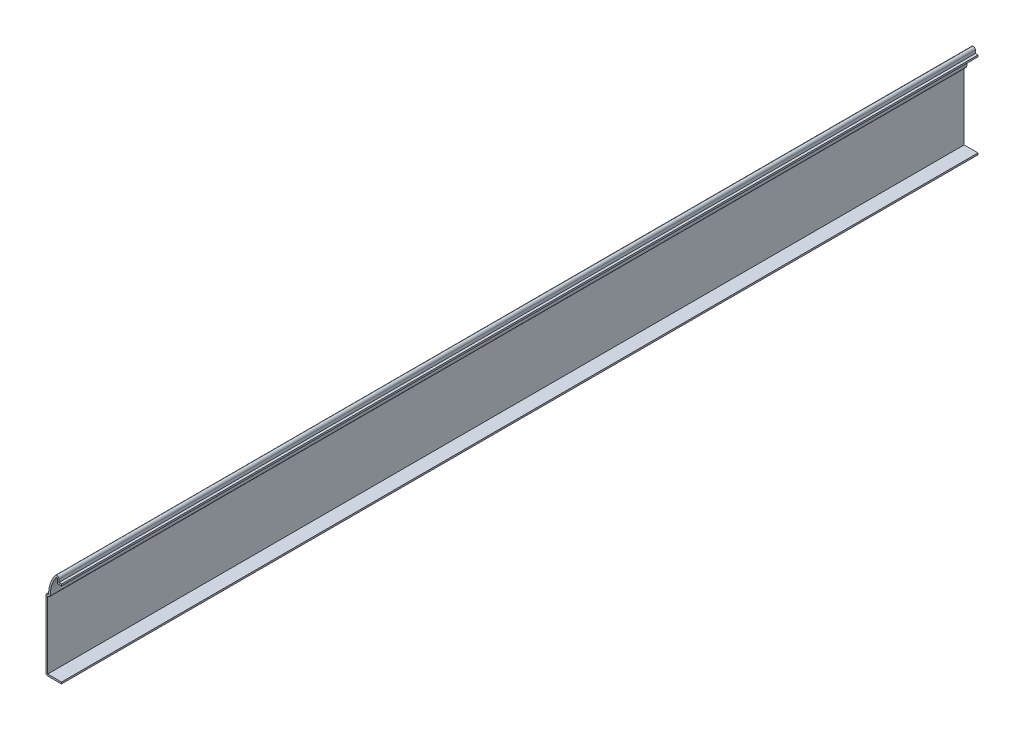
ISO-10303-21;
HEADER;
FILE_DESCRIPTION(('STEP AP214'),'2;1');
FILE_NAME('part.step','',(''),(''),'','','');
FILE_SCHEMA(('AUTOMOTIVE_DESIGN { 1 0 10303 214 1 1 1 1 }'));
ENDSEC;
DATA;
#1=APPLICATION_CONTEXT('core data for automotive mechanical design processes');
#2=APPLICATION_PROTOCOL_DEFINITION('international standard','automotive_design',2000,#1);
#3=PRODUCT_CONTEXT('',#1,'mechanical');
#4=PRODUCT('Part','Part','',(#3));
#5=PRODUCT_RELATED_PRODUCT_CATEGORY('part','',(#4));
#6=PRODUCT_DEFINITION_FORMATION('','',#4);
#7=PRODUCT_DEFINITION_CONTEXT('part definition',#1,'design');
#8=PRODUCT_DEFINITION('design','',#6,#7);
#9=PRODUCT_DEFINITION_SHAPE('','',#8);
#10=(LENGTH_UNIT() NAMED_UNIT(*) SI_UNIT(.MILLI.,.METRE.));
#11=(NAMED_UNIT(*) PLANE_ANGLE_UNIT() SI_UNIT($,.RADIAN.));
#12=(NAMED_UNIT(*) SI_UNIT($,.STERADIAN.) SOLID_ANGLE_UNIT());
#13=UNCERTAINTY_MEASURE_WITH_UNIT(LENGTH_MEASURE(1.E-05),#10,'distance_accuracy_value','');
#14=(GEOMETRIC_REPRESENTATION_CONTEXT(3) GLOBAL_UNCERTAINTY_ASSIGNED_CONTEXT((#13)) GLOBAL_UNIT_ASSIGNED_CONTEXT((#10,
#11,#12)) REPRESENTATION_CONTEXT('',''));
#15=CARTESIAN_POINT('',(0.,0.,0.));
#16=DIRECTION('',(0.,0.,1.));
#17=DIRECTION('',(1.,0.,0.));
#18=AXIS2_PLACEMENT_3D('',#15,#16,#17);
#19=CARTESIAN_POINT('',(-1.5875,52.16525,-563.5625));
#20=DIRECTION('',(0.,-1.,0.));
#21=DIRECTION('',(0.,0.,-1.));
#22=AXIS2_PLACEMENT_3D('',#19,#20,#21);
#23=PLANE('',#22);
#24=DIRECTION('',(1.,0.,0.));
#25=VECTOR('',#24,1.);
#26=CARTESIAN_POINT('',(-1.5875,52.16525,0.));
#27=LINE('',#26,#25);
#28=CARTESIAN_POINT('',(-1.5875,52.16525,0.));
#29=VERTEX_POINT('',#28);
#30=CARTESIAN_POINT('',(0.,52.16525,0.));
#31=VERTEX_POINT('',#30);
#32=EDGE_CURVE('E289',#29,#31,#27,.T.);
#33=ORIENTED_EDGE('',*,*,#32,.F.);
#34=DIRECTION('',(0.,0.,1.));
#35=VECTOR('',#34,1.);
#36=CARTESIAN_POINT('',(-1.5875,52.16525,-563.5625));
#37=LINE('',#36,#35);
#38=CARTESIAN_POINT('',(-1.5875,52.16525,-563.5625));
#39=VERTEX_POINT('',#38);
#40=EDGE_CURVE('E11',#29,#39,#37,.F.);
#41=ORIENTED_EDGE('',*,*,#40,.T.);
#42=DIRECTION('',(1.,0.,0.));
#43=VECTOR('',#42,1.);
#44=CARTESIAN_POINT('',(-1.5875,52.16525,-563.5625));
#45=LINE('',#44,#43);
#46=CARTESIAN_POINT('',(0.,52.16525,-563.5625));
#47=VERTEX_POINT('',#46);
#48=EDGE_CURVE('E173',#39,#47,#45,.T.);
#49=ORIENTED_EDGE('',*,*,#48,.T.);
#50=DIRECTION('',(0.,0.,1.));
#51=VECTOR('',#50,1.);
#52=CARTESIAN_POINT('',(0.,52.16525,-563.5625));
#53=LINE('',#52,#51);
#54=EDGE_CURVE('E177',#47,#31,#53,.T.);
#55=ORIENTED_EDGE('',*,*,#54,.T.);
#56=EDGE_LOOP('',(#33,#41,#49,#55));
#57=FACE_BOUND('',#56,.T.);
#58=ADVANCED_FACE('F35',(#57),#23,.T.);
#59=CARTESIAN_POINT('',(-2.6035,55.08625,-563.5625));
#60=DIRECTION('',(-1.,0.,0.));
#61=DIRECTION('',(0.,0.,1.));
#62=AXIS2_PLACEMENT_3D('',#59,#60,#61);
#63=PLANE('',#62);
#64=DIRECTION('',(0.,1.,0.));
#65=VECTOR('',#64,1.);
#66=CARTESIAN_POINT('',(-2.6035,55.08625,-563.5625));
#67=LINE('',#66,#65);
#68=CARTESIAN_POINT('',(-2.6035,55.08625,-563.5625));
#69=VERTEX_POINT('',#68);
#70=CARTESIAN_POINT('',(-2.6035,53.18125,-563.5625));
#71=VERTEX_POINT('',#70);
#72=EDGE_CURVE('E197',#69,#71,#67,.F.);
#73=ORIENTED_EDGE('',*,*,#72,.T.);
#74=DIRECTION('',(0.,0.,1.));
#75=VECTOR('',#74,1.);
#76=CARTESIAN_POINT('',(-2.6035,53.18125,-563.5625));
#77=LINE('',#76,#75);
#78=CARTESIAN_POINT('',(-2.6035,53.18125,0.));
#79=VERTEX_POINT('',#78);
#80=EDGE_CURVE('E43',#71,#79,#77,.T.);
#81=ORIENTED_EDGE('',*,*,#80,.T.);
#82=DIRECTION('',(0.,1.,0.));
#83=VECTOR('',#82,1.);
#84=CARTESIAN_POINT('',(-2.6035,55.08625,0.));
#85=LINE('',#84,#83);
#86=CARTESIAN_POINT('',(-2.6035,55.08625,0.));
#87=VERTEX_POINT('',#86);
#88=EDGE_CURVE('E182',#87,#79,#85,.F.);
#89=ORIENTED_EDGE('',*,*,#88,.F.);
#90=DIRECTION('',(0.,0.,1.));
#91=VECTOR('',#90,1.);
#92=CARTESIAN_POINT('',(-2.6035,55.08625,-563.5625));
#93=LINE('',#92,#91);
#94=EDGE_CURVE('E209',#69,#87,#93,.T.);
#95=ORIENTED_EDGE('',*,*,#94,.F.);
#96=EDGE_LOOP('',(#73,#81,#89,#95));
#97=FACE_BOUND('',#96,.T.);
#98=ADVANCED_FACE('F240',(#97),#63,.T.);
#99=CARTESIAN_POINT('',(-2.8575,55.08625,-563.5625));
#100=DIRECTION('',(0.,0.,1.));
#101=DIRECTION('',(1.,0.,0.));
#102=AXIS2_PLACEMENT_3D('',#99,#100,#101);
#103=CYLINDRICAL_SURFACE('',#102,0.254000000000013);
#104=CARTESIAN_POINT('',(-2.8575,55.08625,0.));
#105=DIRECTION('',(0.,0.,1.));
#106=DIRECTION('',(1.,0.,0.));
#107=AXIS2_PLACEMENT_3D('',#104,#105,#106);
#108=CIRCLE('',#107,0.254000000000013);
#109=CARTESIAN_POINT('',(-3.06070000000001,55.23865,0.));
#110=VERTEX_POINT('',#109);
#111=EDGE_CURVE('E248',#110,#87,#108,.F.);
#112=ORIENTED_EDGE('',*,*,#111,.F.);
#113=DIRECTION('',(0.,0.,1.));
#114=VECTOR('',#113,1.);
#115=CARTESIAN_POINT('',(-3.06070000000001,55.23865,-563.5625));
#116=LINE('',#115,#114);
#117=CARTESIAN_POINT('',(-3.06070000000001,55.23865,-563.5625));
#118=VERTEX_POINT('',#117);
#119=EDGE_CURVE('E255',#118,#110,#116,.T.);
#120=ORIENTED_EDGE('',*,*,#119,.F.);
#121=CARTESIAN_POINT('',(-2.8575,55.08625,-563.5625));
#122=DIRECTION('',(0.,0.,1.));
#123=DIRECTION('',(1.,0.,0.));
#124=AXIS2_PLACEMENT_3D('',#121,#122,#123);
#125=CIRCLE('',#124,0.254000000000013);
#126=EDGE_CURVE('E202',#118,#69,#125,.F.);
#127=ORIENTED_EDGE('',*,*,#126,.T.);
#128=ORIENTED_EDGE('',*,*,#94,.T.);
#129=EDGE_LOOP('',(#112,#120,#127,#128));
#130=FACE_BOUND('',#129,.T.);
#131=ADVANCED_FACE('F323',(#130),#103,.F.);
#132=CARTESIAN_POINT('',(12.3825,43.65625,-563.5625));
#133=DIRECTION('',(0.,0.,1.));
#134=DIRECTION('',(1.,0.,0.));
#135=AXIS2_PLACEMENT_3D('',#132,#133,#134);
#136=CYLINDRICAL_SURFACE('',#135,19.304);
#137=CARTESIAN_POINT('',(12.3825,43.65625,0.));
#138=DIRECTION('',(0.,0.,1.));
#139=DIRECTION('',(1.,0.,0.));
#140=AXIS2_PLACEMENT_3D('',#137,#138,#139);
#141=CIRCLE('',#140,19.304);
#142=CARTESIAN_POINT('',(-6.92150000000002,43.65625,0.));
#143=VERTEX_POINT('',#142);
#144=EDGE_CURVE('E250',#143,#110,#141,.F.);
#145=ORIENTED_EDGE('',*,*,#144,.F.);
#146=DIRECTION('',(0.,0.,1.));
#147=VECTOR('',#146,1.);
#148=CARTESIAN_POINT('',(-6.92150000000002,43.65625,-563.5625));
#149=LINE('',#148,#147);
#150=CARTESIAN_POINT('',(-6.92150000000002,43.65625,-563.5625));
#151=VERTEX_POINT('',#150);
#152=EDGE_CURVE('E234',#143,#151,#149,.F.);
#153=ORIENTED_EDGE('',*,*,#152,.T.);
#154=CARTESIAN_POINT('',(12.3825,43.65625,-563.5625));
#155=DIRECTION('',(0.,0.,1.));
#156=DIRECTION('',(1.,0.,0.));
#157=AXIS2_PLACEMENT_3D('',#154,#155,#156);
#158=CIRCLE('',#157,19.304);
#159=EDGE_CURVE('E319',#151,#118,#158,.F.);
#160=ORIENTED_EDGE('',*,*,#159,.T.);
#161=ORIENTED_EDGE('',*,*,#119,.T.);
#162=EDGE_LOOP('',(#145,#153,#160,#161));
#163=FACE_BOUND('',#162,.T.);
#164=ADVANCED_FACE('F318',(#163),#136,.F.);
#165=CARTESIAN_POINT('',(-9.525,42.64025,-563.5625));
#166=DIRECTION('',(0.,-1.,0.));
#167=DIRECTION('',(0.,0.,-1.));
#168=AXIS2_PLACEMENT_3D('',#165,#166,#167);
#169=PLANE('',#168);
#170=DIRECTION('',(1.,0.,0.));
#171=VECTOR('',#170,1.);
#172=CARTESIAN_POINT('',(-9.525,42.64025,-563.5625));
#173=LINE('',#172,#171);
#174=CARTESIAN_POINT('',(-8.509,42.64025,-563.5625));
#175=VERTEX_POINT('',#174);
#176=CARTESIAN_POINT('',(-7.93750000000002,42.64025,-563.5625));
#177=VERTEX_POINT('',#176);
#178=EDGE_CURVE('E386',#175,#177,#173,.T.);
#179=ORIENTED_EDGE('',*,*,#178,.T.);
#180=DIRECTION('',(0.,0.,1.));
#181=VECTOR('',#180,1.);
#182=CARTESIAN_POINT('',(-7.93750000000002,42.64025,-563.5625));
#183=LINE('',#182,#181);
#184=CARTESIAN_POINT('',(-7.93750000000002,42.64025,0.));
#185=VERTEX_POINT('',#184);
#186=EDGE_CURVE('E231',#177,#185,#183,.T.);
#187=ORIENTED_EDGE('',*,*,#186,.T.);
#188=DIRECTION('',(1.,0.,0.));
#189=VECTOR('',#188,1.);
#190=CARTESIAN_POINT('',(-9.525,42.64025,0.));
#191=LINE('',#190,#189);
#192=CARTESIAN_POINT('',(-8.509,42.64025,0.));
#193=VERTEX_POINT('',#192);
#194=EDGE_CURVE('E312',#193,#185,#191,.T.);
#195=ORIENTED_EDGE('',*,*,#194,.F.);
#196=DIRECTION('',(0.,0.,1.));
#197=VECTOR('',#196,1.);
#198=CARTESIAN_POINT('',(-8.509,42.64025,-563.5625));
#199=LINE('',#198,#197);
#200=EDGE_CURVE('E258',#175,#193,#199,.T.);
#201=ORIENTED_EDGE('',*,*,#200,.F.);
#202=EDGE_LOOP('',(#179,#187,#195,#201));
#203=FACE_BOUND('',#202,.T.);
#204=ADVANCED_FACE('F390',(#203),#169,.T.);
#205=CARTESIAN_POINT('',(-8.509,0.,-563.5625));
#206=DIRECTION('',(1.,0.,0.));
#207=DIRECTION('',(0.,0.,-1.));
#208=AXIS2_PLACEMENT_3D('',#205,#206,#207);
#209=PLANE('',#208);
#210=DIRECTION('',(0.,1.,0.));
#211=VECTOR('',#210,1.);
#212=CARTESIAN_POINT('',(-8.509,0.,0.));
#213=LINE('',#212,#211);
#214=CARTESIAN_POINT('',(-8.509,1.016,0.));
#215=VERTEX_POINT('',#214);
#216=EDGE_CURVE('E309',#215,#193,#213,.T.);
#217=ORIENTED_EDGE('',*,*,#216,.F.);
#218=DIRECTION('',(0.,0.,1.));
#219=VECTOR('',#218,1.);
#220=CARTESIAN_POINT('',(-8.509,1.016,-563.5625));
#221=LINE('',#220,#219);
#222=CARTESIAN_POINT('',(-8.509,1.016,-563.5625));
#223=VERTEX_POINT('',#222);
#224=EDGE_CURVE('E260',#223,#215,#221,.T.);
#225=ORIENTED_EDGE('',*,*,#224,.F.);
#226=DIRECTION('',(0.,1.,0.));
#227=VECTOR('',#226,1.);
#228=CARTESIAN_POINT('',(-8.509,0.,-563.5625));
#229=LINE('',#228,#227);
#230=EDGE_CURVE('E383',#223,#175,#229,.T.);
#231=ORIENTED_EDGE('',*,*,#230,.T.);
#232=ORIENTED_EDGE('',*,*,#200,.T.);
#233=EDGE_LOOP('',(#217,#225,#231,#232));
#234=FACE_BOUND('',#233,.T.);
#235=ADVANCED_FACE('F396',(#234),#209,.T.);
#236=CARTESIAN_POINT('',(0.,1.016,-563.5625));
#237=DIRECTION('',(0.,1.,0.));
#238=DIRECTION('',(0.,0.,1.));
#239=AXIS2_PLACEMENT_3D('',#236,#237,#238);
#240=PLANE('',#239);
#241=DIRECTION('',(1.,0.,0.));
#242=VECTOR('',#241,1.);
#243=CARTESIAN_POINT('',(0.,1.016,0.));
#244=LINE('',#243,#242);
#245=CARTESIAN_POINT('',(0.,1.016,0.));
#246=VERTEX_POINT('',#245);
#247=EDGE_CURVE('E306',#246,#215,#244,.F.);
#248=ORIENTED_EDGE('',*,*,#247,.F.);
#249=DIRECTION('',(0.,0.,1.));
#250=VECTOR('',#249,1.);
#251=CARTESIAN_POINT('',(0.,1.016,-563.5625));
#252=LINE('',#251,#250);
#253=CARTESIAN_POINT('',(0.,1.016,-563.5625));
#254=VERTEX_POINT('',#253);
#255=EDGE_CURVE('E262',#254,#246,#252,.T.);
#256=ORIENTED_EDGE('',*,*,#255,.F.);
#257=DIRECTION('',(1.,0.,0.));
#258=VECTOR('',#257,1.);
#259=CARTESIAN_POINT('',(0.,1.016,-563.5625));
#260=LINE('',#259,#258);
#261=EDGE_CURVE('E380',#254,#223,#260,.F.);
#262=ORIENTED_EDGE('',*,*,#261,.T.);
#263=ORIENTED_EDGE('',*,*,#224,.T.);
#264=EDGE_LOOP('',(#248,#256,#262,#263));
#265=FACE_BOUND('',#264,.T.);
#266=ADVANCED_FACE('F399',(#265),#240,.T.);
#267=CARTESIAN_POINT('',(0.,1.016,-563.5625));
#268=DIRECTION('',(-1.,0.,0.));
#269=DIRECTION('',(0.,0.,1.));
#270=AXIS2_PLACEMENT_3D('',#267,#268,#269);
#271=PLANE('',#270);
#272=DIRECTION('',(0.,-1.,0.));
#273=VECTOR('',#272,1.);
#274=CARTESIAN_POINT('',(0.,1.016,0.));
#275=LINE('',#274,#273);
#276=CARTESIAN_POINT('',(0.,0.,0.));
#277=VERTEX_POINT('',#276);
#278=EDGE_CURVE('E304',#246,#277,#275,.T.);
#279=ORIENTED_EDGE('',*,*,#278,.T.);
#280=DIRECTION('',(0.,0.,1.));
#281=VECTOR('',#280,1.);
#282=CARTESIAN_POINT('',(0.,0.,-563.5625));
#283=LINE('',#282,#281);
#284=CARTESIAN_POINT('',(0.,0.,-563.5625));
#285=VERTEX_POINT('',#284);
#286=EDGE_CURVE('E264',#285,#277,#283,.T.);
#287=ORIENTED_EDGE('',*,*,#286,.F.);
#288=DIRECTION('',(0.,-1.,0.));
#289=VECTOR('',#288,1.);
#290=CARTESIAN_POINT('',(0.,1.016,-563.5625));
#291=LINE('',#290,#289);
#292=EDGE_CURVE('E378',#254,#285,#291,.T.);
#293=ORIENTED_EDGE('',*,*,#292,.F.);
#294=ORIENTED_EDGE('',*,*,#255,.T.);
#295=EDGE_LOOP('',(#279,#287,#293,#294));
#296=FACE_BOUND('',#295,.T.);
#297=ADVANCED_FACE('F405',(#296),#271,.F.);
#298=CARTESIAN_POINT('',(0.,0.,-563.5625));
#299=DIRECTION('',(0.,1.,0.));
#300=DIRECTION('',(0.,0.,1.));
#301=AXIS2_PLACEMENT_3D('',#298,#299,#300);
#302=PLANE('',#301);
#303=DIRECTION('',(-1.,0.,0.));
#304=VECTOR('',#303,1.);
#305=CARTESIAN_POINT('',(0.,0.,0.));
#306=LINE('',#305,#304);
#307=CARTESIAN_POINT('',(-8.509,0.,0.));
#308=VERTEX_POINT('',#307);
#309=EDGE_CURVE('E301',#277,#308,#306,.T.);
#310=ORIENTED_EDGE('',*,*,#309,.T.);
#311=DIRECTION('',(0.,0.,1.));
#312=VECTOR('',#311,1.);
#313=CARTESIAN_POINT('',(-8.509,0.,-563.5625));
#314=LINE('',#313,#312);
#315=CARTESIAN_POINT('',(-8.509,0.,-563.5625));
#316=VERTEX_POINT('',#315);
#317=EDGE_CURVE('E220',#308,#316,#314,.F.);
#318=ORIENTED_EDGE('',*,*,#317,.T.);
#319=DIRECTION('',(-1.,0.,0.));
#320=VECTOR('',#319,1.);
#321=CARTESIAN_POINT('',(0.,0.,-563.5625));
#322=LINE('',#321,#320);
#323=EDGE_CURVE('E376',#285,#316,#322,.T.);
#324=ORIENTED_EDGE('',*,*,#323,.F.);
#325=ORIENTED_EDGE('',*,*,#286,.T.);
#326=EDGE_LOOP('',(#310,#318,#324,#325));
#327=FACE_BOUND('',#326,.T.);
#328=ADVANCED_FACE('F409',(#327),#302,.F.);
#329=CARTESIAN_POINT('',(-9.525,0.,-563.5625));
#330=DIRECTION('',(1.,0.,0.));
#331=DIRECTION('',(0.,0.,-1.));
#332=AXIS2_PLACEMENT_3D('',#329,#330,#331);
#333=PLANE('',#332);
#334=DIRECTION('',(0.,1.,0.));
#335=VECTOR('',#334,1.);
#336=CARTESIAN_POINT('',(-9.525,0.,-563.5625));
#337=LINE('',#336,#335);
#338=CARTESIAN_POINT('',(-9.525,1.016,-563.5625));
#339=VERTEX_POINT('',#338);
#340=CARTESIAN_POINT('',(-9.525,42.64025,-563.5625));
#341=VERTEX_POINT('',#340);
#342=EDGE_CURVE('E374',#339,#341,#337,.T.);
#343=ORIENTED_EDGE('',*,*,#342,.F.);
#344=DIRECTION('',(0.,0.,1.));
#345=VECTOR('',#344,1.);
#346=CARTESIAN_POINT('',(-9.525,1.016,-563.5625));
#347=LINE('',#346,#345);
#348=CARTESIAN_POINT('',(-9.525,1.016,0.));
#349=VERTEX_POINT('',#348);
#350=EDGE_CURVE('E208',#339,#349,#347,.T.);
#351=ORIENTED_EDGE('',*,*,#350,.T.);
#352=DIRECTION('',(0.,1.,0.));
#353=VECTOR('',#352,1.);
#354=CARTESIAN_POINT('',(-9.525,0.,0.));
#355=LINE('',#354,#353);
#356=CARTESIAN_POINT('',(-9.525,42.64025,0.));
#357=VERTEX_POINT('',#356);
#358=EDGE_CURVE('E298',#349,#357,#355,.T.);
#359=ORIENTED_EDGE('',*,*,#358,.T.);
#360=DIRECTION('',(0.,0.,1.));
#361=VECTOR('',#360,1.);
#362=CARTESIAN_POINT('',(-9.525,42.64025,-563.5625));
#363=LINE('',#362,#361);
#364=EDGE_CURVE('E206',#357,#341,#363,.F.);
#365=ORIENTED_EDGE('',*,*,#364,.T.);
#366=EDGE_LOOP('',(#343,#351,#359,#365));
#367=FACE_BOUND('',#366,.T.);
#368=ADVANCED_FACE('F414',(#367),#333,.F.);
#369=CARTESIAN_POINT('',(-9.525,43.65625,-563.5625));
#370=DIRECTION('',(0.,-1.,0.));
#371=DIRECTION('',(0.,0.,-1.));
#372=AXIS2_PLACEMENT_3D('',#369,#370,#371);
#373=PLANE('',#372);
#374=DIRECTION('',(1.,0.,0.));
#375=VECTOR('',#374,1.);
#376=CARTESIAN_POINT('',(-9.525,43.65625,-563.5625));
#377=LINE('',#376,#375);
#378=CARTESIAN_POINT('',(-8.509,43.65625,-563.5625));
#379=VERTEX_POINT('',#378);
#380=CARTESIAN_POINT('',(-7.9375,43.65625,-563.5625));
#381=VERTEX_POINT('',#380);
#382=EDGE_CURVE('E355',#379,#381,#377,.T.);
#383=ORIENTED_EDGE('',*,*,#382,.F.);
#384=DIRECTION('',(0.,0.,1.));
#385=VECTOR('',#384,1.);
#386=CARTESIAN_POINT('',(-8.509,43.65625,-563.5625));
#387=LINE('',#386,#385);
#388=CARTESIAN_POINT('',(-8.509,43.65625,0.));
#389=VERTEX_POINT('',#388);
#390=EDGE_CURVE('E228',#379,#389,#387,.T.);
#391=ORIENTED_EDGE('',*,*,#390,.T.);
#392=DIRECTION('',(1.,0.,0.));
#393=VECTOR('',#392,1.);
#394=CARTESIAN_POINT('',(-9.525,43.65625,0.));
#395=LINE('',#394,#393);
#396=CARTESIAN_POINT('',(-7.9375,43.65625,0.));
#397=VERTEX_POINT('',#396);
#398=EDGE_CURVE('E296',#389,#397,#395,.T.);
#399=ORIENTED_EDGE('',*,*,#398,.T.);
#400=DIRECTION('',(0.,0.,1.));
#401=VECTOR('',#400,1.);
#402=CARTESIAN_POINT('',(-7.9375,43.65625,-563.5625));
#403=LINE('',#402,#401);
#404=EDGE_CURVE('E267',#381,#397,#403,.T.);
#405=ORIENTED_EDGE('',*,*,#404,.F.);
#406=EDGE_LOOP('',(#383,#391,#399,#405));
#407=FACE_BOUND('',#406,.T.);
#408=ADVANCED_FACE('F353',(#407),#373,.F.);
#409=CARTESIAN_POINT('',(12.3825,43.65625,-563.5625));
#410=DIRECTION('',(0.,0.,1.));
#411=DIRECTION('',(1.,0.,0.));
#412=AXIS2_PLACEMENT_3D('',#409,#410,#411);
#413=CYLINDRICAL_SURFACE('',#412,20.32);
#414=CARTESIAN_POINT('',(12.3825,43.65625,0.));
#415=DIRECTION('',(0.,0.,-1.));
#416=DIRECTION('',(-1.,0.,0.));
#417=AXIS2_PLACEMENT_3D('',#414,#415,#416);
#418=CIRCLE('',#417,20.32);
#419=CARTESIAN_POINT('',(-3.87350000000001,55.84825,0.));
#420=VERTEX_POINT('',#419);
#421=EDGE_CURVE('E294',#397,#420,#418,.T.);
#422=ORIENTED_EDGE('',*,*,#421,.T.);
#423=DIRECTION('',(0.,0.,1.));
#424=VECTOR('',#423,1.);
#425=CARTESIAN_POINT('',(-3.87350000000001,55.84825,-563.5625));
#426=LINE('',#425,#424);
#427=CARTESIAN_POINT('',(-3.87350000000001,55.84825,-563.5625));
#428=VERTEX_POINT('',#427);
#429=EDGE_CURVE('E270',#428,#420,#426,.T.);
#430=ORIENTED_EDGE('',*,*,#429,.F.);
#431=CARTESIAN_POINT('',(12.3825,43.65625,-563.5625));
#432=DIRECTION('',(0.,0.,-1.));
#433=DIRECTION('',(-1.,0.,0.));
#434=AXIS2_PLACEMENT_3D('',#431,#432,#433);
#435=CIRCLE('',#434,20.32);
#436=EDGE_CURVE('E366',#381,#428,#435,.T.);
#437=ORIENTED_EDGE('',*,*,#436,.F.);
#438=ORIENTED_EDGE('',*,*,#404,.T.);
#439=EDGE_LOOP('',(#422,#430,#437,#438));
#440=FACE_BOUND('',#439,.T.);
#441=ADVANCED_FACE('F359',(#440),#413,.T.);
#442=CARTESIAN_POINT('',(-2.8575,55.08625,-563.5625));
#443=DIRECTION('',(0.,0.,1.));
#444=DIRECTION('',(1.,0.,0.));
#445=AXIS2_PLACEMENT_3D('',#442,#443,#444);
#446=CYLINDRICAL_SURFACE('',#445,1.27000000000001);
#447=CARTESIAN_POINT('',(-2.8575,55.08625,0.));
#448=DIRECTION('',(0.,0.,-1.));
#449=DIRECTION('',(-1.,0.,0.));
#450=AXIS2_PLACEMENT_3D('',#447,#448,#449);
#451=CIRCLE('',#450,1.27000000000001);
#452=CARTESIAN_POINT('',(-1.58749999999999,55.08625,0.));
#453=VERTEX_POINT('',#452);
#454=EDGE_CURVE('E287',#420,#453,#451,.T.);
#455=ORIENTED_EDGE('',*,*,#454,.T.);
#456=DIRECTION('',(0.,0.,1.));
#457=VECTOR('',#456,1.);
#458=CARTESIAN_POINT('',(-1.58749999999999,55.08625,-563.5625));
#459=LINE('',#458,#457);
#460=CARTESIAN_POINT('',(-1.58749999999999,55.08625,-563.5625));
#461=VERTEX_POINT('',#460);
#462=EDGE_CURVE('E273',#461,#453,#459,.T.);
#463=ORIENTED_EDGE('',*,*,#462,.F.);
#464=CARTESIAN_POINT('',(-2.8575,55.08625,-563.5625));
#465=DIRECTION('',(0.,0.,-1.));
#466=DIRECTION('',(-1.,0.,0.));
#467=AXIS2_PLACEMENT_3D('',#464,#465,#466);
#468=CIRCLE('',#467,1.27000000000001);
#469=EDGE_CURVE('E365',#428,#461,#468,.T.);
#470=ORIENTED_EDGE('',*,*,#469,.F.);
#471=ORIENTED_EDGE('',*,*,#429,.T.);
#472=EDGE_LOOP('',(#455,#463,#470,#471));
#473=FACE_BOUND('',#472,.T.);
#474=ADVANCED_FACE('F363',(#473),#446,.T.);
#475=CARTESIAN_POINT('',(-1.5875,55.08625,-563.5625));
#476=DIRECTION('',(-1.,0.,0.));
#477=DIRECTION('',(0.,0.,1.));
#478=AXIS2_PLACEMENT_3D('',#475,#476,#477);
#479=PLANE('',#478);
#480=DIRECTION('',(0.,-1.,0.));
#481=VECTOR('',#480,1.);
#482=CARTESIAN_POINT('',(-1.5875,55.08625,0.));
#483=LINE('',#482,#481);
#484=CARTESIAN_POINT('',(-1.5875,53.18125,0.));
#485=VERTEX_POINT('',#484);
#486=EDGE_CURVE('E285',#453,#485,#483,.T.);
#487=ORIENTED_EDGE('',*,*,#486,.T.);
#488=DIRECTION('',(0.,0.,1.));
#489=VECTOR('',#488,1.);
#490=CARTESIAN_POINT('',(-1.5875,53.18125,-563.5625));
#491=LINE('',#490,#489);
#492=CARTESIAN_POINT('',(-1.5875,53.18125,-563.5625));
#493=VERTEX_POINT('',#492);
#494=EDGE_CURVE('E199',#493,#485,#491,.T.);
#495=ORIENTED_EDGE('',*,*,#494,.F.);
#496=DIRECTION('',(0.,-1.,0.));
#497=VECTOR('',#496,1.);
#498=CARTESIAN_POINT('',(-1.5875,55.08625,-563.5625));
#499=LINE('',#498,#497);
#500=EDGE_CURVE('E367',#461,#493,#499,.T.);
#501=ORIENTED_EDGE('',*,*,#500,.F.);
#502=ORIENTED_EDGE('',*,*,#462,.T.);
#503=EDGE_LOOP('',(#487,#495,#501,#502));
#504=FACE_BOUND('',#503,.T.);
#505=ADVANCED_FACE('F429',(#504),#479,.F.);
#506=CARTESIAN_POINT('',(-1.5875,53.18125,-563.5625));
#507=DIRECTION('',(0.,-1.,0.));
#508=DIRECTION('',(0.,0.,-1.));
#509=AXIS2_PLACEMENT_3D('',#506,#507,#508);
#510=PLANE('',#509);
#511=DIRECTION('',(1.,0.,0.));
#512=VECTOR('',#511,1.);
#513=CARTESIAN_POINT('',(-1.5875,53.18125,0.));
#514=LINE('',#513,#512);
#515=CARTESIAN_POINT('',(0.,53.18125,0.));
#516=VERTEX_POINT('',#515);
#517=EDGE_CURVE('E280',#485,#516,#514,.T.);
#518=ORIENTED_EDGE('',*,*,#517,.T.);
#519=DIRECTION('',(0.,0.,1.));
#520=VECTOR('',#519,1.);
#521=CARTESIAN_POINT('',(0.,53.18125,-563.5625));
#522=LINE('',#521,#520);
#523=CARTESIAN_POINT('',(0.,53.18125,-563.5625));
#524=VERTEX_POINT('',#523);
#525=EDGE_CURVE('E196',#524,#516,#522,.T.);
#526=ORIENTED_EDGE('',*,*,#525,.F.);
#527=DIRECTION('',(1.,0.,0.));
#528=VECTOR('',#527,1.);
#529=CARTESIAN_POINT('',(-1.5875,53.18125,-563.5625));
#530=LINE('',#529,#528);
#531=EDGE_CURVE('E188',#493,#524,#530,.T.);
#532=ORIENTED_EDGE('',*,*,#531,.F.);
#533=ORIENTED_EDGE('',*,*,#494,.T.);
#534=EDGE_LOOP('',(#518,#526,#532,#533));
#535=FACE_BOUND('',#534,.T.);
#536=ADVANCED_FACE('F279',(#535),#510,.F.);
#537=CARTESIAN_POINT('',(0.,53.18125,-563.5625));
#538=DIRECTION('',(-1.,0.,0.));
#539=DIRECTION('',(0.,0.,1.));
#540=AXIS2_PLACEMENT_3D('',#537,#538,#539);
#541=PLANE('',#540);
#542=DIRECTION('',(0.,-1.,0.));
#543=VECTOR('',#542,1.);
#544=CARTESIAN_POINT('',(0.,53.18125,0.));
#545=LINE('',#544,#543);
#546=EDGE_CURVE('E195',#516,#31,#545,.T.);
#547=ORIENTED_EDGE('',*,*,#546,.T.);
#548=ORIENTED_EDGE('',*,*,#54,.F.);
#549=DIRECTION('',(0.,-1.,0.));
#550=VECTOR('',#549,1.);
#551=CARTESIAN_POINT('',(0.,53.18125,-563.5625));
#552=LINE('',#551,#550);
#553=EDGE_CURVE('E181',#524,#47,#552,.T.);
#554=ORIENTED_EDGE('',*,*,#553,.F.);
#555=ORIENTED_EDGE('',*,*,#525,.T.);
#556=EDGE_LOOP('',(#547,#548,#554,#555));
#557=FACE_BOUND('',#556,.T.);
#558=ADVANCED_FACE('F193',(#557),#541,.F.);
#559=CARTESIAN_POINT('',(-2.8575,55.08625,-563.5625));
#560=DIRECTION('',(0.,0.,-1.));
#561=DIRECTION('',(-1.,0.,0.));
#562=AXIS2_PLACEMENT_3D('',#559,#560,#561);
#563=PLANE('',#562);
#564=ORIENTED_EDGE('',*,*,#323,.T.);
#565=CARTESIAN_POINT('',(-8.509,1.016,-563.5625));
#566=DIRECTION('',(0.,0.,-1.));
#567=DIRECTION('',(-1.,0.,0.));
#568=AXIS2_PLACEMENT_3D('',#565,#566,#567);
#569=CIRCLE('',#568,1.016);
#570=EDGE_CURVE('E226',#316,#339,#569,.T.);
#571=ORIENTED_EDGE('',*,*,#570,.T.);
#572=ORIENTED_EDGE('',*,*,#342,.T.);
#573=CARTESIAN_POINT('',(-8.509,42.64025,-563.5625));
#574=DIRECTION('',(0.,0.,-1.));
#575=DIRECTION('',(-1.,0.,0.));
#576=AXIS2_PLACEMENT_3D('',#573,#574,#575);
#577=CIRCLE('',#576,1.016);
#578=EDGE_CURVE('E50',#341,#379,#577,.T.);
#579=ORIENTED_EDGE('',*,*,#578,.T.);
#580=ORIENTED_EDGE('',*,*,#382,.T.);
#581=ORIENTED_EDGE('',*,*,#436,.T.);
#582=ORIENTED_EDGE('',*,*,#469,.T.);
#583=ORIENTED_EDGE('',*,*,#500,.T.);
#584=ORIENTED_EDGE('',*,*,#531,.T.);
#585=ORIENTED_EDGE('',*,*,#553,.T.);
#586=ORIENTED_EDGE('',*,*,#48,.F.);
#587=CARTESIAN_POINT('',(-1.5875,53.18125,-563.5625));
#588=DIRECTION('',(0.,0.,-1.));
#589=DIRECTION('',(-1.,0.,0.));
#590=AXIS2_PLACEMENT_3D('',#587,#588,#589);
#591=CIRCLE('',#590,1.016);
#592=EDGE_CURVE('E222',#39,#71,#591,.T.);
#593=ORIENTED_EDGE('',*,*,#592,.T.);
#594=ORIENTED_EDGE('',*,*,#72,.F.);
#595=ORIENTED_EDGE('',*,*,#126,.F.);
#596=ORIENTED_EDGE('',*,*,#159,.F.);
#597=CARTESIAN_POINT('',(-7.93750000000002,43.65625,-563.5625));
#598=DIRECTION('',(0.,0.,-1.));
#599=DIRECTION('',(-1.,0.,0.));
#600=AXIS2_PLACEMENT_3D('',#597,#598,#599);
#601=CIRCLE('',#600,1.016);
#602=EDGE_CURVE('E57',#151,#177,#601,.T.);
#603=ORIENTED_EDGE('',*,*,#602,.T.);
#604=ORIENTED_EDGE('',*,*,#178,.F.);
#605=ORIENTED_EDGE('',*,*,#230,.F.);
#606=ORIENTED_EDGE('',*,*,#261,.F.);
#607=ORIENTED_EDGE('',*,*,#292,.T.);
#608=EDGE_LOOP('',(#564,#571,#572,#579,#580,#581,#582,#583,#584,#585,#586,#593,#594,#595,#596,
#603,#604,#605,#606,#607));
#609=FACE_BOUND('',#608,.T.);
#610=ADVANCED_FACE('F186',(#609),#563,.T.);
#611=CARTESIAN_POINT('',(-2.8575,55.08625,0.));
#612=DIRECTION('',(0.,0.,-1.));
#613=DIRECTION('',(-1.,0.,0.));
#614=AXIS2_PLACEMENT_3D('',#611,#612,#613);
#615=PLANE('',#614);
#616=ORIENTED_EDGE('',*,*,#358,.F.);
#617=CARTESIAN_POINT('',(-8.509,1.016,0.));
#618=DIRECTION('',(0.,0.,-1.));
#619=DIRECTION('',(-1.,0.,0.));
#620=AXIS2_PLACEMENT_3D('',#617,#618,#619);
#621=CIRCLE('',#620,1.016);
#622=EDGE_CURVE('E218',#349,#308,#621,.F.);
#623=ORIENTED_EDGE('',*,*,#622,.T.);
#624=ORIENTED_EDGE('',*,*,#309,.F.);
#625=ORIENTED_EDGE('',*,*,#278,.F.);
#626=ORIENTED_EDGE('',*,*,#247,.T.);
#627=ORIENTED_EDGE('',*,*,#216,.T.);
#628=ORIENTED_EDGE('',*,*,#194,.T.);
#629=CARTESIAN_POINT('',(-7.93750000000002,43.65625,0.));
#630=DIRECTION('',(0.,0.,-1.));
#631=DIRECTION('',(-1.,0.,0.));
#632=AXIS2_PLACEMENT_3D('',#629,#630,#631);
#633=CIRCLE('',#632,1.016);
#634=EDGE_CURVE('E214',#185,#143,#633,.F.);
#635=ORIENTED_EDGE('',*,*,#634,.T.);
#636=ORIENTED_EDGE('',*,*,#144,.T.);
#637=ORIENTED_EDGE('',*,*,#111,.T.);
#638=ORIENTED_EDGE('',*,*,#88,.T.);
#639=CARTESIAN_POINT('',(-1.5875,53.18125,0.));
#640=DIRECTION('',(0.,0.,-1.));
#641=DIRECTION('',(-1.,0.,0.));
#642=AXIS2_PLACEMENT_3D('',#639,#640,#641);
#643=CIRCLE('',#642,1.016);
#644=EDGE_CURVE('E212',#79,#29,#643,.F.);
#645=ORIENTED_EDGE('',*,*,#644,.T.);
#646=ORIENTED_EDGE('',*,*,#32,.T.);
#647=ORIENTED_EDGE('',*,*,#546,.F.);
#648=ORIENTED_EDGE('',*,*,#517,.F.);
#649=ORIENTED_EDGE('',*,*,#486,.F.);
#650=ORIENTED_EDGE('',*,*,#454,.F.);
#651=ORIENTED_EDGE('',*,*,#421,.F.);
#652=ORIENTED_EDGE('',*,*,#398,.F.);
#653=CARTESIAN_POINT('',(-8.509,42.64025,0.));
#654=DIRECTION('',(0.,0.,-1.));
#655=DIRECTION('',(-1.,0.,0.));
#656=AXIS2_PLACEMENT_3D('',#653,#654,#655);
#657=CIRCLE('',#656,1.016);
#658=EDGE_CURVE('E216',#389,#357,#657,.F.);
#659=ORIENTED_EDGE('',*,*,#658,.T.);
#660=EDGE_LOOP('',(#616,#623,#624,#625,#626,#627,#628,#635,#636,#637,#638,#645,#646,#647,#648,
#649,#650,#651,#652,#659));
#661=FACE_BOUND('',#660,.T.);
#662=ADVANCED_FACE('F246',(#661),#615,.F.);
#663=CARTESIAN_POINT('',(-8.509,1.016,-563.5625));
#664=DIRECTION('',(0.,0.,1.));
#665=DIRECTION('',(1.,0.,0.));
#666=AXIS2_PLACEMENT_3D('',#663,#664,#665);
#667=CYLINDRICAL_SURFACE('',#666,1.016);
#668=ORIENTED_EDGE('',*,*,#570,.F.);
#669=ORIENTED_EDGE('',*,*,#317,.F.);
#670=ORIENTED_EDGE('',*,*,#622,.F.);
#671=ORIENTED_EDGE('',*,*,#350,.F.);
#672=EDGE_LOOP('',(#668,#669,#670,#671));
#673=FACE_BOUND('',#672,.T.);
#674=ADVANCED_FACE('F341',(#673),#667,.T.);
#675=CARTESIAN_POINT('',(-8.509,42.64025,-563.5625));
#676=DIRECTION('',(0.,0.,1.));
#677=DIRECTION('',(1.,0.,0.));
#678=AXIS2_PLACEMENT_3D('',#675,#676,#677);
#679=CYLINDRICAL_SURFACE('',#678,1.016);
#680=ORIENTED_EDGE('',*,*,#578,.F.);
#681=ORIENTED_EDGE('',*,*,#364,.F.);
#682=ORIENTED_EDGE('',*,*,#658,.F.);
#683=ORIENTED_EDGE('',*,*,#390,.F.);
#684=EDGE_LOOP('',(#680,#681,#682,#683));
#685=FACE_BOUND('',#684,.T.);
#686=ADVANCED_FACE('F330',(#685),#679,.T.);
#687=CARTESIAN_POINT('',(-7.93750000000002,43.65625,-563.5625));
#688=DIRECTION('',(0.,0.,1.));
#689=DIRECTION('',(1.,0.,0.));
#690=AXIS2_PLACEMENT_3D('',#687,#688,#689);
#691=CYLINDRICAL_SURFACE('',#690,1.016);
#692=ORIENTED_EDGE('',*,*,#602,.F.);
#693=ORIENTED_EDGE('',*,*,#152,.F.);
#694=ORIENTED_EDGE('',*,*,#634,.F.);
#695=ORIENTED_EDGE('',*,*,#186,.F.);
#696=EDGE_LOOP('',(#692,#693,#694,#695));
#697=FACE_BOUND('',#696,.T.);
#698=ADVANCED_FACE('F326',(#697),#691,.T.);
#699=CARTESIAN_POINT('',(-1.5875,53.18125,-563.5625));
#700=DIRECTION('',(0.,0.,1.));
#701=DIRECTION('',(1.,0.,0.));
#702=AXIS2_PLACEMENT_3D('',#699,#700,#701);
#703=CYLINDRICAL_SURFACE('',#702,1.016);
#704=ORIENTED_EDGE('',*,*,#592,.F.);
#705=ORIENTED_EDGE('',*,*,#40,.F.);
#706=ORIENTED_EDGE('',*,*,#644,.F.);
#707=ORIENTED_EDGE('',*,*,#80,.F.);
#708=EDGE_LOOP('',(#704,#705,#706,#707));
#709=FACE_BOUND('',#708,.T.);
#710=ADVANCED_FACE('F37',(#709),#703,.T.);
#711=CLOSED_SHELL('',(#58,#98,#131,#164,#204,#235,#266,#297,#328,#368,#408,#441,#474,#505,#536,
#558,#610,#662,#674,#686,#698,#710));
#712=MANIFOLD_SOLID_BREP('B2',#711);
#713=ADVANCED_BREP_SHAPE_REPRESENTATION('',(#18,#712),#14);
#714=SHAPE_DEFINITION_REPRESENTATION(#9,#713);
ENDSEC;
END-ISO-10303-21;
